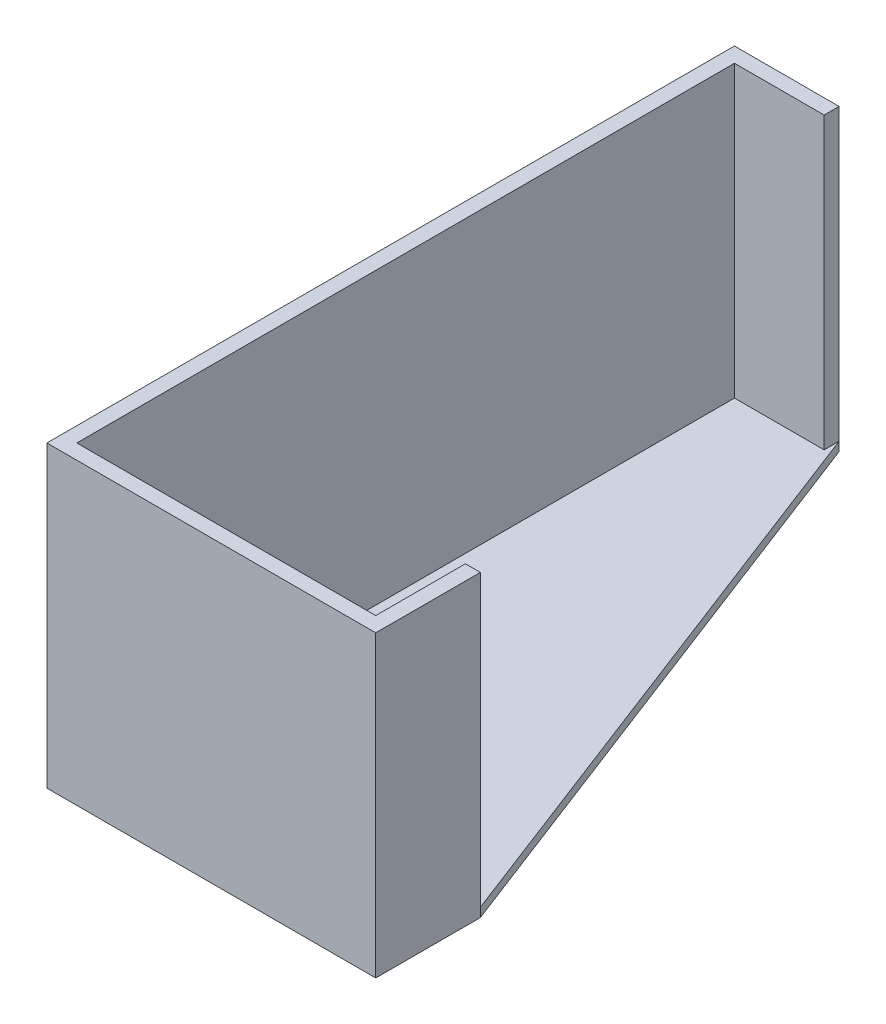
ISO-10303-21;
HEADER;
FILE_DESCRIPTION(('STEP AP214'),'2;1');
FILE_NAME('part.step','',(''),(''),'','','');
FILE_SCHEMA(('AUTOMOTIVE_DESIGN { 1 0 10303 214 1 1 1 1 }'));
ENDSEC;
DATA;
#1=APPLICATION_CONTEXT('core data for automotive mechanical design processes');
#2=APPLICATION_PROTOCOL_DEFINITION('international standard','automotive_design',2000,#1);
#3=PRODUCT_CONTEXT('',#1,'mechanical');
#4=PRODUCT('Part','Part','',(#3));
#5=PRODUCT_RELATED_PRODUCT_CATEGORY('part','',(#4));
#6=PRODUCT_DEFINITION_FORMATION('','',#4);
#7=PRODUCT_DEFINITION_CONTEXT('part definition',#1,'design');
#8=PRODUCT_DEFINITION('design','',#6,#7);
#9=PRODUCT_DEFINITION_SHAPE('','',#8);
#10=(LENGTH_UNIT() NAMED_UNIT(*) SI_UNIT(.MILLI.,.METRE.));
#11=(NAMED_UNIT(*) PLANE_ANGLE_UNIT() SI_UNIT($,.RADIAN.));
#12=(NAMED_UNIT(*) SI_UNIT($,.STERADIAN.) SOLID_ANGLE_UNIT());
#13=UNCERTAINTY_MEASURE_WITH_UNIT(LENGTH_MEASURE(1.E-05),#10,'distance_accuracy_value','');
#14=(GEOMETRIC_REPRESENTATION_CONTEXT(3) GLOBAL_UNCERTAINTY_ASSIGNED_CONTEXT((#13)) GLOBAL_UNIT_ASSIGNED_CONTEXT((#10,
#11,#12)) REPRESENTATION_CONTEXT('',''));
#15=CARTESIAN_POINT('',(0.,0.,0.));
#16=DIRECTION('',(0.,0.,1.));
#17=DIRECTION('',(1.,0.,0.));
#18=AXIS2_PLACEMENT_3D('',#15,#16,#17);
#19=CARTESIAN_POINT('',(100.,100.,0.));
#20=DIRECTION('',(1.,0.,0.));
#21=DIRECTION('',(0.,0.,-1.));
#22=AXIS2_PLACEMENT_3D('',#19,#20,#21);
#23=PLANE('',#22);
#24=DIRECTION('',(0.,-1.,0.));
#25=VECTOR('',#24,1.);
#26=CARTESIAN_POINT('',(100.,100.,-30.));
#27=LINE('',#26,#25);
#28=CARTESIAN_POINT('',(100.,100.,-30.));
#29=VERTEX_POINT('',#28);
#30=CARTESIAN_POINT('',(100.,3.,-30.));
#31=VERTEX_POINT('',#30);
#32=EDGE_CURVE('E152',#29,#31,#27,.T.);
#33=ORIENTED_EDGE('',*,*,#32,.T.);
#34=DIRECTION('',(0.,0.,1.));
#35=VECTOR('',#34,1.);
#36=CARTESIAN_POINT('',(100.,3.,0.));
#37=LINE('',#36,#35);
#38=CARTESIAN_POINT('',(100.,3.,0.));
#39=VERTEX_POINT('',#38);
#40=EDGE_CURVE('E49',#31,#39,#37,.T.);
#41=ORIENTED_EDGE('',*,*,#40,.T.);
#42=DIRECTION('',(0.,-1.,0.));
#43=VECTOR('',#42,1.);
#44=CARTESIAN_POINT('',(100.,100.,0.));
#45=LINE('',#44,#43);
#46=CARTESIAN_POINT('',(100.,100.,0.));
#47=VERTEX_POINT('',#46);
#48=EDGE_CURVE('E42',#47,#39,#45,.T.);
#49=ORIENTED_EDGE('',*,*,#48,.F.);
#50=DIRECTION('',(0.,0.,1.));
#51=VECTOR('',#50,1.);
#52=CARTESIAN_POINT('',(100.,100.,0.));
#53=LINE('',#52,#51);
#54=EDGE_CURVE('E123',#29,#47,#53,.T.);
#55=ORIENTED_EDGE('',*,*,#54,.F.);
#56=EDGE_LOOP('',(#33,#41,#49,#55));
#57=FACE_BOUND('',#56,.T.);
#58=ADVANCED_FACE('F35',(#57),#23,.F.);
#59=CARTESIAN_POINT('',(100.,100.,0.));
#60=DIRECTION('',(0.,0.,1.));
#61=DIRECTION('',(1.,0.,0.));
#62=AXIS2_PLACEMENT_3D('',#59,#60,#61);
#63=PLANE('',#62);
#64=ORIENTED_EDGE('',*,*,#48,.T.);
#65=DIRECTION('',(-1.,0.,0.));
#66=VECTOR('',#65,1.);
#67=CARTESIAN_POINT('',(100.,3.,0.));
#68=LINE('',#67,#66);
#69=CARTESIAN_POINT('',(0.,3.,0.));
#70=VERTEX_POINT('',#69);
#71=EDGE_CURVE('E56',#39,#70,#68,.T.);
#72=ORIENTED_EDGE('',*,*,#71,.T.);
#73=DIRECTION('',(0.,-1.,0.));
#74=VECTOR('',#73,1.);
#75=CARTESIAN_POINT('',(0.,100.,0.));
#76=LINE('',#75,#74);
#77=CARTESIAN_POINT('',(0.,100.,0.));
#78=VERTEX_POINT('',#77);
#79=EDGE_CURVE('E119',#78,#70,#76,.T.);
#80=ORIENTED_EDGE('',*,*,#79,.F.);
#81=DIRECTION('',(-1.,0.,0.));
#82=VECTOR('',#81,1.);
#83=CARTESIAN_POINT('',(100.,100.,0.));
#84=LINE('',#83,#82);
#85=EDGE_CURVE('E116',#47,#78,#84,.T.);
#86=ORIENTED_EDGE('',*,*,#85,.F.);
#87=EDGE_LOOP('',(#64,#72,#80,#86));
#88=FACE_BOUND('',#87,.T.);
#89=ADVANCED_FACE('F118',(#88),#63,.F.);
#90=CARTESIAN_POINT('',(0.,100.,0.));
#91=DIRECTION('',(-1.,0.,0.));
#92=DIRECTION('',(0.,0.,1.));
#93=AXIS2_PLACEMENT_3D('',#90,#91,#92);
#94=PLANE('',#93);
#95=ORIENTED_EDGE('',*,*,#79,.T.);
#96=DIRECTION('',(0.,0.,-1.));
#97=VECTOR('',#96,1.);
#98=CARTESIAN_POINT('',(0.,3.,0.));
#99=LINE('',#98,#97);
#100=CARTESIAN_POINT('',(0.,3.,-220.));
#101=VERTEX_POINT('',#100);
#102=EDGE_CURVE('E182',#70,#101,#99,.T.);
#103=ORIENTED_EDGE('',*,*,#102,.T.);
#104=DIRECTION('',(0.,-1.,0.));
#105=VECTOR('',#104,1.);
#106=CARTESIAN_POINT('',(0.,100.,-220.));
#107=LINE('',#106,#105);
#108=CARTESIAN_POINT('',(0.,100.,-220.));
#109=VERTEX_POINT('',#108);
#110=EDGE_CURVE('E132',#109,#101,#107,.T.);
#111=ORIENTED_EDGE('',*,*,#110,.F.);
#112=DIRECTION('',(0.,0.,-1.));
#113=VECTOR('',#112,1.);
#114=CARTESIAN_POINT('',(0.,100.,0.));
#115=LINE('',#114,#113);
#116=EDGE_CURVE('E122',#78,#109,#115,.T.);
#117=ORIENTED_EDGE('',*,*,#116,.F.);
#118=EDGE_LOOP('',(#95,#103,#111,#117));
#119=FACE_BOUND('',#118,.T.);
#120=ADVANCED_FACE('F235',(#119),#94,.F.);
#121=CARTESIAN_POINT('',(0.,100.,-220.));
#122=DIRECTION('',(0.,0.,-1.));
#123=DIRECTION('',(-1.,0.,0.));
#124=AXIS2_PLACEMENT_3D('',#121,#122,#123);
#125=PLANE('',#124);
#126=ORIENTED_EDGE('',*,*,#110,.T.);
#127=DIRECTION('',(1.,0.,0.));
#128=VECTOR('',#127,1.);
#129=CARTESIAN_POINT('',(0.,3.,-220.));
#130=LINE('',#129,#128);
#131=CARTESIAN_POINT('',(30.,3.,-220.));
#132=VERTEX_POINT('',#131);
#133=EDGE_CURVE('E180',#101,#132,#130,.T.);
#134=ORIENTED_EDGE('',*,*,#133,.T.);
#135=DIRECTION('',(0.,-1.,0.));
#136=VECTOR('',#135,1.);
#137=CARTESIAN_POINT('',(30.,100.,-220.));
#138=LINE('',#137,#136);
#139=CARTESIAN_POINT('',(30.,100.,-220.));
#140=VERTEX_POINT('',#139);
#141=EDGE_CURVE('E137',#140,#132,#138,.T.);
#142=ORIENTED_EDGE('',*,*,#141,.F.);
#143=DIRECTION('',(1.,0.,0.));
#144=VECTOR('',#143,1.);
#145=CARTESIAN_POINT('',(0.,100.,-220.));
#146=LINE('',#145,#144);
#147=EDGE_CURVE('E176',#109,#140,#146,.T.);
#148=ORIENTED_EDGE('',*,*,#147,.F.);
#149=EDGE_LOOP('',(#126,#134,#142,#148));
#150=FACE_BOUND('',#149,.T.);
#151=ADVANCED_FACE('F231',(#150),#125,.F.);
#152=CARTESIAN_POINT('',(30.,100.,-220.));
#153=DIRECTION('',(-1.,0.,0.));
#154=DIRECTION('',(0.,0.,1.));
#155=AXIS2_PLACEMENT_3D('',#152,#153,#154);
#156=PLANE('',#155);
#157=ORIENTED_EDGE('',*,*,#141,.T.);
#158=DIRECTION('',(0.,0.,-1.));
#159=VECTOR('',#158,1.);
#160=CARTESIAN_POINT('',(30.,3.,-220.));
#161=LINE('',#160,#159);
#162=CARTESIAN_POINT('',(30.,3.,-225.));
#163=VERTEX_POINT('',#162);
#164=EDGE_CURVE('E164',#132,#163,#161,.T.);
#165=ORIENTED_EDGE('',*,*,#164,.T.);
#166=DIRECTION('',(0.,-1.,0.));
#167=VECTOR('',#166,1.);
#168=CARTESIAN_POINT('',(30.,100.,-225.));
#169=LINE('',#168,#167);
#170=CARTESIAN_POINT('',(30.,100.,-225.));
#171=VERTEX_POINT('',#170);
#172=EDGE_CURVE('E140',#171,#163,#169,.T.);
#173=ORIENTED_EDGE('',*,*,#172,.F.);
#174=DIRECTION('',(0.,0.,-1.));
#175=VECTOR('',#174,1.);
#176=CARTESIAN_POINT('',(30.,100.,-220.));
#177=LINE('',#176,#175);
#178=EDGE_CURVE('E174',#140,#171,#177,.T.);
#179=ORIENTED_EDGE('',*,*,#178,.F.);
#180=EDGE_LOOP('',(#157,#165,#173,#179));
#181=FACE_BOUND('',#180,.T.);
#182=ADVANCED_FACE('F227',(#181),#156,.F.);
#183=CARTESIAN_POINT('',(-5.,100.,-225.));
#184=DIRECTION('',(0.,0.,1.));
#185=DIRECTION('',(1.,0.,0.));
#186=AXIS2_PLACEMENT_3D('',#183,#184,#185);
#187=PLANE('',#186);
#188=ORIENTED_EDGE('',*,*,#172,.T.);
#189=DIRECTION('',(0.,-1.,0.));
#190=VECTOR('',#189,1.);
#191=CARTESIAN_POINT('',(30.,3.,-225.));
#192=LINE('',#191,#190);
#193=CARTESIAN_POINT('',(30.,0.,-225.));
#194=VERTEX_POINT('',#193);
#195=EDGE_CURVE('E186',#163,#194,#192,.T.);
#196=ORIENTED_EDGE('',*,*,#195,.T.);
#197=DIRECTION('',(-1.,0.,0.));
#198=VECTOR('',#197,1.);
#199=CARTESIAN_POINT('',(-5.,0.,-225.));
#200=LINE('',#199,#198);
#201=CARTESIAN_POINT('',(-5.,0.,-225.));
#202=VERTEX_POINT('',#201);
#203=EDGE_CURVE('E161',#194,#202,#200,.T.);
#204=ORIENTED_EDGE('',*,*,#203,.T.);
#205=DIRECTION('',(0.,-1.,0.));
#206=VECTOR('',#205,1.);
#207=CARTESIAN_POINT('',(-5.,100.,-225.));
#208=LINE('',#207,#206);
#209=CARTESIAN_POINT('',(-5.,100.,-225.));
#210=VERTEX_POINT('',#209);
#211=EDGE_CURVE('E143',#210,#202,#208,.T.);
#212=ORIENTED_EDGE('',*,*,#211,.F.);
#213=DIRECTION('',(-1.,0.,0.));
#214=VECTOR('',#213,1.);
#215=CARTESIAN_POINT('',(-5.,100.,-225.));
#216=LINE('',#215,#214);
#217=EDGE_CURVE('E172',#171,#210,#216,.T.);
#218=ORIENTED_EDGE('',*,*,#217,.F.);
#219=EDGE_LOOP('',(#188,#196,#204,#212,#218));
#220=FACE_BOUND('',#219,.T.);
#221=ADVANCED_FACE('F221',(#220),#187,.F.);
#222=CARTESIAN_POINT('',(-5.,100.,5.));
#223=DIRECTION('',(1.,0.,0.));
#224=DIRECTION('',(0.,0.,-1.));
#225=AXIS2_PLACEMENT_3D('',#222,#223,#224);
#226=PLANE('',#225);
#227=ORIENTED_EDGE('',*,*,#211,.T.);
#228=DIRECTION('',(0.,0.,1.));
#229=VECTOR('',#228,1.);
#230=CARTESIAN_POINT('',(-5.,0.,5.));
#231=LINE('',#230,#229);
#232=CARTESIAN_POINT('',(-5.,0.,5.));
#233=VERTEX_POINT('',#232);
#234=EDGE_CURVE('E158',#202,#233,#231,.T.);
#235=ORIENTED_EDGE('',*,*,#234,.T.);
#236=DIRECTION('',(0.,-1.,0.));
#237=VECTOR('',#236,1.);
#238=CARTESIAN_POINT('',(-5.,100.,5.));
#239=LINE('',#238,#237);
#240=CARTESIAN_POINT('',(-5.,100.,5.));
#241=VERTEX_POINT('',#240);
#242=EDGE_CURVE('E145',#241,#233,#239,.T.);
#243=ORIENTED_EDGE('',*,*,#242,.F.);
#244=DIRECTION('',(0.,0.,1.));
#245=VECTOR('',#244,1.);
#246=CARTESIAN_POINT('',(-5.,100.,5.));
#247=LINE('',#246,#245);
#248=EDGE_CURVE('E170',#210,#241,#247,.T.);
#249=ORIENTED_EDGE('',*,*,#248,.F.);
#250=EDGE_LOOP('',(#227,#235,#243,#249));
#251=FACE_BOUND('',#250,.T.);
#252=ADVANCED_FACE('F239',(#251),#226,.F.);
#253=CARTESIAN_POINT('',(105.,100.,5.));
#254=DIRECTION('',(0.,0.,-1.));
#255=DIRECTION('',(-1.,0.,0.));
#256=AXIS2_PLACEMENT_3D('',#253,#254,#255);
#257=PLANE('',#256);
#258=ORIENTED_EDGE('',*,*,#242,.T.);
#259=DIRECTION('',(1.,0.,0.));
#260=VECTOR('',#259,1.);
#261=CARTESIAN_POINT('',(105.,0.,5.));
#262=LINE('',#261,#260);
#263=CARTESIAN_POINT('',(105.,0.,5.));
#264=VERTEX_POINT('',#263);
#265=EDGE_CURVE('E155',#233,#264,#262,.T.);
#266=ORIENTED_EDGE('',*,*,#265,.T.);
#267=DIRECTION('',(0.,-1.,0.));
#268=VECTOR('',#267,1.);
#269=CARTESIAN_POINT('',(105.,100.,5.));
#270=LINE('',#269,#268);
#271=CARTESIAN_POINT('',(105.,100.,5.));
#272=VERTEX_POINT('',#271);
#273=EDGE_CURVE('E147',#272,#264,#270,.T.);
#274=ORIENTED_EDGE('',*,*,#273,.F.);
#275=DIRECTION('',(1.,0.,0.));
#276=VECTOR('',#275,1.);
#277=CARTESIAN_POINT('',(105.,100.,5.));
#278=LINE('',#277,#276);
#279=EDGE_CURVE('E168',#241,#272,#278,.T.);
#280=ORIENTED_EDGE('',*,*,#279,.F.);
#281=EDGE_LOOP('',(#258,#266,#274,#280));
#282=FACE_BOUND('',#281,.T.);
#283=ADVANCED_FACE('F241',(#282),#257,.F.);
#284=CARTESIAN_POINT('',(105.,100.,5.));
#285=DIRECTION('',(-1.,0.,0.));
#286=DIRECTION('',(0.,0.,1.));
#287=AXIS2_PLACEMENT_3D('',#284,#285,#286);
#288=PLANE('',#287);
#289=ORIENTED_EDGE('',*,*,#273,.T.);
#290=DIRECTION('',(0.,0.,-1.));
#291=VECTOR('',#290,1.);
#292=CARTESIAN_POINT('',(105.,0.,5.));
#293=LINE('',#292,#291);
#294=CARTESIAN_POINT('',(105.,0.,-30.));
#295=VERTEX_POINT('',#294);
#296=EDGE_CURVE('E130',#264,#295,#293,.T.);
#297=ORIENTED_EDGE('',*,*,#296,.T.);
#298=DIRECTION('',(0.,-1.,0.));
#299=VECTOR('',#298,1.);
#300=CARTESIAN_POINT('',(105.,3.,-30.));
#301=LINE('',#300,#299);
#302=CARTESIAN_POINT('',(105.,3.,-30.));
#303=VERTEX_POINT('',#302);
#304=EDGE_CURVE('E187',#303,#295,#301,.T.);
#305=ORIENTED_EDGE('',*,*,#304,.F.);
#306=DIRECTION('',(0.,-1.,0.));
#307=VECTOR('',#306,1.);
#308=CARTESIAN_POINT('',(105.,100.,-30.));
#309=LINE('',#308,#307);
#310=CARTESIAN_POINT('',(105.,100.,-30.));
#311=VERTEX_POINT('',#310);
#312=EDGE_CURVE('E149',#311,#303,#309,.T.);
#313=ORIENTED_EDGE('',*,*,#312,.F.);
#314=DIRECTION('',(0.,0.,-1.));
#315=VECTOR('',#314,1.);
#316=CARTESIAN_POINT('',(105.,100.,5.));
#317=LINE('',#316,#315);
#318=EDGE_CURVE('E166',#272,#311,#317,.T.);
#319=ORIENTED_EDGE('',*,*,#318,.F.);
#320=EDGE_LOOP('',(#289,#297,#305,#313,#319));
#321=FACE_BOUND('',#320,.T.);
#322=ADVANCED_FACE('F211',(#321),#288,.F.);
#323=CARTESIAN_POINT('',(100.,100.,-30.));
#324=DIRECTION('',(0.,0.,1.));
#325=DIRECTION('',(1.,0.,0.));
#326=AXIS2_PLACEMENT_3D('',#323,#324,#325);
#327=PLANE('',#326);
#328=ORIENTED_EDGE('',*,*,#312,.T.);
#329=DIRECTION('',(-1.,0.,0.));
#330=VECTOR('',#329,1.);
#331=CARTESIAN_POINT('',(100.,3.,-30.));
#332=LINE('',#331,#330);
#333=EDGE_CURVE('E11',#303,#31,#332,.T.);
#334=ORIENTED_EDGE('',*,*,#333,.T.);
#335=ORIENTED_EDGE('',*,*,#32,.F.);
#336=DIRECTION('',(-1.,0.,0.));
#337=VECTOR('',#336,1.);
#338=CARTESIAN_POINT('',(100.,100.,-30.));
#339=LINE('',#338,#337);
#340=EDGE_CURVE('E128',#311,#29,#339,.T.);
#341=ORIENTED_EDGE('',*,*,#340,.F.);
#342=EDGE_LOOP('',(#328,#334,#335,#341));
#343=FACE_BOUND('',#342,.T.);
#344=ADVANCED_FACE('F207',(#343),#327,.F.);
#345=CARTESIAN_POINT('',(0.,100.,0.));
#346=DIRECTION('',(0.,-1.,0.));
#347=DIRECTION('',(0.,0.,-1.));
#348=AXIS2_PLACEMENT_3D('',#345,#346,#347);
#349=PLANE('',#348);
#350=ORIENTED_EDGE('',*,*,#54,.T.);
#351=ORIENTED_EDGE('',*,*,#85,.T.);
#352=ORIENTED_EDGE('',*,*,#116,.T.);
#353=ORIENTED_EDGE('',*,*,#147,.T.);
#354=ORIENTED_EDGE('',*,*,#178,.T.);
#355=ORIENTED_EDGE('',*,*,#217,.T.);
#356=ORIENTED_EDGE('',*,*,#248,.T.);
#357=ORIENTED_EDGE('',*,*,#279,.T.);
#358=ORIENTED_EDGE('',*,*,#318,.T.);
#359=ORIENTED_EDGE('',*,*,#340,.T.);
#360=EDGE_LOOP('',(#350,#351,#352,#353,#354,#355,#356,#357,#358,#359));
#361=FACE_BOUND('',#360,.T.);
#362=ADVANCED_FACE('F126',(#361),#349,.F.);
#363=CARTESIAN_POINT('',(0.,0.,0.));
#364=DIRECTION('',(0.,-1.,0.));
#365=DIRECTION('',(0.,0.,-1.));
#366=AXIS2_PLACEMENT_3D('',#363,#364,#365);
#367=PLANE('',#366);
#368=ORIENTED_EDGE('',*,*,#203,.F.);
#369=DIRECTION('',(0.358979079308869,0.,0.933345606203059));
#370=VECTOR('',#369,1.);
#371=CARTESIAN_POINT('',(105.,0.,-30.));
#372=LINE('',#371,#370);
#373=EDGE_CURVE('E192',#194,#295,#372,.T.);
#374=ORIENTED_EDGE('',*,*,#373,.T.);
#375=ORIENTED_EDGE('',*,*,#296,.F.);
#376=ORIENTED_EDGE('',*,*,#265,.F.);
#377=ORIENTED_EDGE('',*,*,#234,.F.);
#378=EDGE_LOOP('',(#368,#374,#375,#376,#377));
#379=FACE_BOUND('',#378,.T.);
#380=ADVANCED_FACE('F217',(#379),#367,.T.);
#381=CARTESIAN_POINT('',(0.,3.,0.));
#382=DIRECTION('',(0.,1.,0.));
#383=DIRECTION('',(0.,0.,1.));
#384=AXIS2_PLACEMENT_3D('',#381,#382,#383);
#385=PLANE('',#384);
#386=ORIENTED_EDGE('',*,*,#164,.F.);
#387=ORIENTED_EDGE('',*,*,#133,.F.);
#388=ORIENTED_EDGE('',*,*,#102,.F.);
#389=ORIENTED_EDGE('',*,*,#71,.F.);
#390=ORIENTED_EDGE('',*,*,#40,.F.);
#391=ORIENTED_EDGE('',*,*,#333,.F.);
#392=DIRECTION('',(0.358979079308869,0.,0.933345606203059));
#393=VECTOR('',#392,1.);
#394=CARTESIAN_POINT('',(105.,3.,-30.));
#395=LINE('',#394,#393);
#396=EDGE_CURVE('E190',#163,#303,#395,.T.);
#397=ORIENTED_EDGE('',*,*,#396,.F.);
#398=EDGE_LOOP('',(#386,#387,#388,#389,#390,#391,#397));
#399=FACE_BOUND('',#398,.T.);
#400=ADVANCED_FACE('F204',(#399),#385,.T.);
#401=CARTESIAN_POINT('',(105.,3.,-30.));
#402=DIRECTION('',(0.93334560620306,0.,-0.358979079308869));
#403=DIRECTION('',(-0.358979079308869,0.,-0.93334560620306));
#404=AXIS2_PLACEMENT_3D('',#401,#402,#403);
#405=PLANE('',#404);
#406=ORIENTED_EDGE('',*,*,#373,.F.);
#407=ORIENTED_EDGE('',*,*,#195,.F.);
#408=ORIENTED_EDGE('',*,*,#396,.T.);
#409=ORIENTED_EDGE('',*,*,#304,.T.);
#410=EDGE_LOOP('',(#406,#407,#408,#409));
#411=FACE_BOUND('',#410,.T.);
#412=ADVANCED_FACE('F200',(#411),#405,.T.);
#413=CLOSED_SHELL('',(#58,#89,#120,#151,#182,#221,#252,#283,#322,#344,#362,#380,#400,#412));
#414=MANIFOLD_SOLID_BREP('B2',#413);
#415=ADVANCED_BREP_SHAPE_REPRESENTATION('',(#18,#414),#14);
#416=SHAPE_DEFINITION_REPRESENTATION(#9,#415);
ENDSEC;
END-ISO-10303-21;
